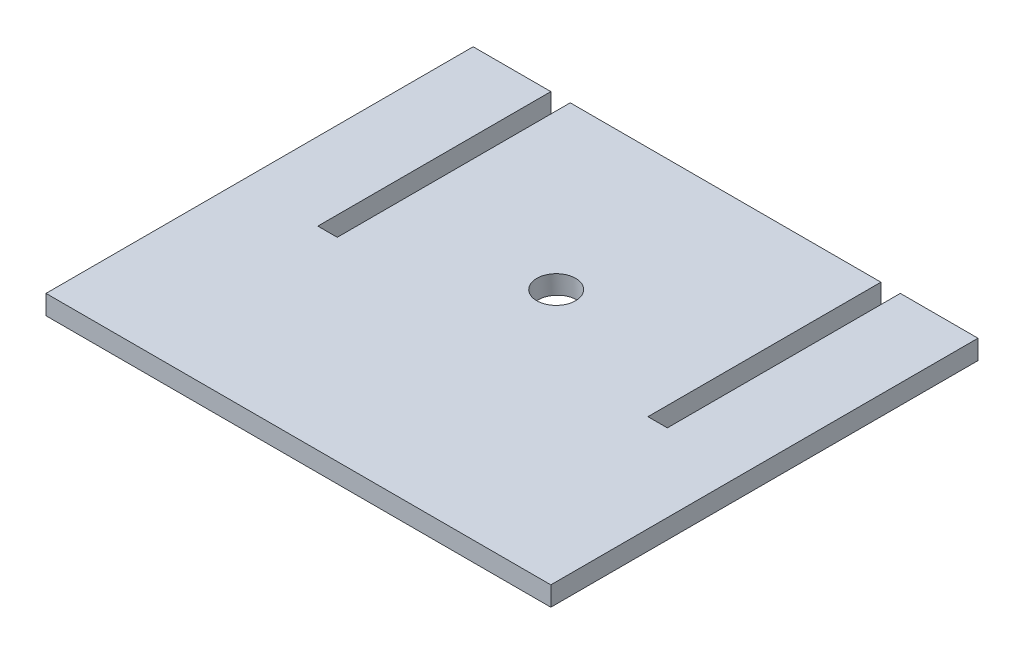
ISO-10303-21;
HEADER;
FILE_DESCRIPTION(('STEP AP214'),'2;1');
FILE_NAME('part.step','',(''),(''),'','','');
FILE_SCHEMA(('AUTOMOTIVE_DESIGN { 1 0 10303 214 1 1 1 1 }'));
ENDSEC;
DATA;
#1=APPLICATION_CONTEXT('core data for automotive mechanical design processes');
#2=APPLICATION_PROTOCOL_DEFINITION('international standard','automotive_design',2000,#1);
#3=PRODUCT_CONTEXT('',#1,'mechanical');
#4=PRODUCT('Part','Part','',(#3));
#5=PRODUCT_RELATED_PRODUCT_CATEGORY('part','',(#4));
#6=PRODUCT_DEFINITION_FORMATION('','',#4);
#7=PRODUCT_DEFINITION_CONTEXT('part definition',#1,'design');
#8=PRODUCT_DEFINITION('design','',#6,#7);
#9=PRODUCT_DEFINITION_SHAPE('','',#8);
#10=(LENGTH_UNIT() NAMED_UNIT(*) SI_UNIT(.MILLI.,.METRE.));
#11=(NAMED_UNIT(*) PLANE_ANGLE_UNIT() SI_UNIT($,.RADIAN.));
#12=(NAMED_UNIT(*) SI_UNIT($,.STERADIAN.) SOLID_ANGLE_UNIT());
#13=UNCERTAINTY_MEASURE_WITH_UNIT(LENGTH_MEASURE(1.E-05),#10,'distance_accuracy_value','');
#14=(GEOMETRIC_REPRESENTATION_CONTEXT(3) GLOBAL_UNCERTAINTY_ASSIGNED_CONTEXT((#13)) GLOBAL_UNIT_ASSIGNED_CONTEXT((#10,
#11,#12)) REPRESENTATION_CONTEXT('',''));
#15=CARTESIAN_POINT('',(0.,0.,0.));
#16=DIRECTION('',(0.,0.,1.));
#17=DIRECTION('',(1.,0.,0.));
#18=AXIS2_PLACEMENT_3D('',#15,#16,#17);
#19=CARTESIAN_POINT('',(-165.1,6.35,-139.7));
#20=DIRECTION('',(0.,0.,1.));
#21=DIRECTION('',(1.,0.,0.));
#22=AXIS2_PLACEMENT_3D('',#19,#20,#21);
#23=PLANE('',#22);
#24=DIRECTION('',(-1.,0.,0.));
#25=VECTOR('',#24,1.);
#26=CARTESIAN_POINT('',(-165.1,6.35,-139.7));
#27=LINE('',#26,#25);
#28=CARTESIAN_POINT('',(-114.3,6.35,-139.7));
#29=VERTEX_POINT('',#28);
#30=CARTESIAN_POINT('',(-165.1,6.35,-139.7));
#31=VERTEX_POINT('',#30);
#32=EDGE_CURVE('E239',#29,#31,#27,.T.);
#33=ORIENTED_EDGE('',*,*,#32,.F.);
#34=DIRECTION('',(0.,1.,0.));
#35=VECTOR('',#34,1.);
#36=CARTESIAN_POINT('',(-114.3,-6.35,-139.7));
#37=LINE('',#36,#35);
#38=CARTESIAN_POINT('',(-114.3,-6.35,-139.7));
#39=VERTEX_POINT('',#38);
#40=EDGE_CURVE('E213',#39,#29,#37,.T.);
#41=ORIENTED_EDGE('',*,*,#40,.F.);
#42=DIRECTION('',(-1.,0.,0.));
#43=VECTOR('',#42,1.);
#44=CARTESIAN_POINT('',(-165.1,-6.35,-139.7));
#45=LINE('',#44,#43);
#46=CARTESIAN_POINT('',(-165.1,-6.35,-139.7));
#47=VERTEX_POINT('',#46);
#48=EDGE_CURVE('E261',#39,#47,#45,.T.);
#49=ORIENTED_EDGE('',*,*,#48,.T.);
#50=DIRECTION('',(0.,-1.,0.));
#51=VECTOR('',#50,1.);
#52=CARTESIAN_POINT('',(-165.1,6.35,-139.7));
#53=LINE('',#52,#51);
#54=EDGE_CURVE('E245',#31,#47,#53,.T.);
#55=ORIENTED_EDGE('',*,*,#54,.F.);
#56=EDGE_LOOP('',(#33,#41,#49,#55));
#57=FACE_BOUND('',#56,.T.);
#58=ADVANCED_FACE('F41',(#57),#23,.F.);
#59=CARTESIAN_POINT('',(165.1,-6.35,-139.7));
#60=VERTEX_POINT('',#59);
#61=CARTESIAN_POINT('',(114.3,-6.35,-139.7));
#62=VERTEX_POINT('',#61);
#63=EDGE_CURVE('E203',#60,#62,#45,.T.);
#64=ORIENTED_EDGE('',*,*,#63,.T.);
#65=DIRECTION('',(0.,1.,0.));
#66=VECTOR('',#65,1.);
#67=CARTESIAN_POINT('',(114.3,-6.35,-139.7));
#68=LINE('',#67,#66);
#69=CARTESIAN_POINT('',(114.3,6.35,-139.7));
#70=VERTEX_POINT('',#69);
#71=EDGE_CURVE('E198',#62,#70,#68,.T.);
#72=ORIENTED_EDGE('',*,*,#71,.T.);
#73=CARTESIAN_POINT('',(165.1,6.35,-139.7));
#74=VERTEX_POINT('',#73);
#75=EDGE_CURVE('E237',#74,#70,#27,.T.);
#76=ORIENTED_EDGE('',*,*,#75,.F.);
#77=DIRECTION('',(0.,-1.,0.));
#78=VECTOR('',#77,1.);
#79=CARTESIAN_POINT('',(165.1,6.35,-139.7));
#80=LINE('',#79,#78);
#81=EDGE_CURVE('E202',#74,#60,#80,.T.);
#82=ORIENTED_EDGE('',*,*,#81,.T.);
#83=EDGE_LOOP('',(#64,#72,#76,#82));
#84=FACE_BOUND('',#83,.T.);
#85=ADVANCED_FACE('F285',(#84),#23,.F.);
#86=CARTESIAN_POINT('',(165.1,6.35,139.7));
#87=DIRECTION('',(-1.,0.,0.));
#88=DIRECTION('',(0.,0.,1.));
#89=AXIS2_PLACEMENT_3D('',#86,#87,#88);
#90=PLANE('',#89);
#91=DIRECTION('',(0.,0.,-1.));
#92=VECTOR('',#91,1.);
#93=CARTESIAN_POINT('',(165.1,-6.35,139.7));
#94=LINE('',#93,#92);
#95=CARTESIAN_POINT('',(165.1,-6.35,139.7));
#96=VERTEX_POINT('',#95);
#97=EDGE_CURVE('E244',#96,#60,#94,.T.);
#98=ORIENTED_EDGE('',*,*,#97,.T.);
#99=ORIENTED_EDGE('',*,*,#81,.F.);
#100=DIRECTION('',(0.,0.,-1.));
#101=VECTOR('',#100,1.);
#102=CARTESIAN_POINT('',(165.1,6.35,139.7));
#103=LINE('',#102,#101);
#104=CARTESIAN_POINT('',(165.1,6.35,139.7));
#105=VERTEX_POINT('',#104);
#106=EDGE_CURVE('E268',#105,#74,#103,.T.);
#107=ORIENTED_EDGE('',*,*,#106,.F.);
#108=DIRECTION('',(0.,-1.,0.));
#109=VECTOR('',#108,1.);
#110=CARTESIAN_POINT('',(165.1,6.35,139.7));
#111=LINE('',#110,#109);
#112=EDGE_CURVE('E252',#105,#96,#111,.T.);
#113=ORIENTED_EDGE('',*,*,#112,.T.);
#114=EDGE_LOOP('',(#98,#99,#107,#113));
#115=FACE_BOUND('',#114,.T.);
#116=ADVANCED_FACE('F282',(#115),#90,.F.);
#117=CARTESIAN_POINT('',(101.6,-6.35,-139.7));
#118=VERTEX_POINT('',#117);
#119=CARTESIAN_POINT('',(-101.6,-6.35,-139.7));
#120=VERTEX_POINT('',#119);
#121=EDGE_CURVE('E175',#118,#120,#45,.T.);
#122=ORIENTED_EDGE('',*,*,#121,.T.);
#123=DIRECTION('',(0.,1.,0.));
#124=VECTOR('',#123,1.);
#125=CARTESIAN_POINT('',(-101.6,-6.35,-139.7));
#126=LINE('',#125,#124);
#127=CARTESIAN_POINT('',(-101.6,6.35,-139.7));
#128=VERTEX_POINT('',#127);
#129=EDGE_CURVE('E77',#120,#128,#126,.T.);
#130=ORIENTED_EDGE('',*,*,#129,.T.);
#131=CARTESIAN_POINT('',(101.6,6.35,-139.7));
#132=VERTEX_POINT('',#131);
#133=EDGE_CURVE('E231',#132,#128,#27,.T.);
#134=ORIENTED_EDGE('',*,*,#133,.F.);
#135=DIRECTION('',(0.,1.,0.));
#136=VECTOR('',#135,1.);
#137=CARTESIAN_POINT('',(101.6,-6.35,-139.7));
#138=LINE('',#137,#136);
#139=EDGE_CURVE('E190',#118,#132,#138,.T.);
#140=ORIENTED_EDGE('',*,*,#139,.F.);
#141=EDGE_LOOP('',(#122,#130,#134,#140));
#142=FACE_BOUND('',#141,.T.);
#143=ADVANCED_FACE('F303',(#142),#23,.F.);
#144=CARTESIAN_POINT('',(-165.1,6.35,139.7));
#145=DIRECTION('',(1.,0.,0.));
#146=DIRECTION('',(0.,0.,-1.));
#147=AXIS2_PLACEMENT_3D('',#144,#145,#146);
#148=PLANE('',#147);
#149=DIRECTION('',(0.,0.,1.));
#150=VECTOR('',#149,1.);
#151=CARTESIAN_POINT('',(-165.1,-6.35,139.7));
#152=LINE('',#151,#150);
#153=CARTESIAN_POINT('',(-165.1,-6.35,139.7));
#154=VERTEX_POINT('',#153);
#155=EDGE_CURVE('E212',#47,#154,#152,.T.);
#156=ORIENTED_EDGE('',*,*,#155,.T.);
#157=DIRECTION('',(0.,-1.,0.));
#158=VECTOR('',#157,1.);
#159=CARTESIAN_POINT('',(-165.1,6.35,139.7));
#160=LINE('',#159,#158);
#161=CARTESIAN_POINT('',(-165.1,6.35,139.7));
#162=VERTEX_POINT('',#161);
#163=EDGE_CURVE('E249',#162,#154,#160,.T.);
#164=ORIENTED_EDGE('',*,*,#163,.F.);
#165=DIRECTION('',(0.,0.,1.));
#166=VECTOR('',#165,1.);
#167=CARTESIAN_POINT('',(-165.1,6.35,139.7));
#168=LINE('',#167,#166);
#169=EDGE_CURVE('E269',#31,#162,#168,.T.);
#170=ORIENTED_EDGE('',*,*,#169,.F.);
#171=ORIENTED_EDGE('',*,*,#54,.T.);
#172=EDGE_LOOP('',(#156,#164,#170,#171));
#173=FACE_BOUND('',#172,.T.);
#174=ADVANCED_FACE('F296',(#173),#148,.F.);
#175=CARTESIAN_POINT('',(-165.1,6.35,139.7));
#176=DIRECTION('',(0.,0.,-1.));
#177=DIRECTION('',(-1.,0.,0.));
#178=AXIS2_PLACEMENT_3D('',#175,#176,#177);
#179=PLANE('',#178);
#180=DIRECTION('',(1.,0.,0.));
#181=VECTOR('',#180,1.);
#182=CARTESIAN_POINT('',(-165.1,-6.35,139.7));
#183=LINE('',#182,#181);
#184=EDGE_CURVE('E248',#154,#96,#183,.T.);
#185=ORIENTED_EDGE('',*,*,#184,.T.);
#186=ORIENTED_EDGE('',*,*,#112,.F.);
#187=DIRECTION('',(1.,0.,0.));
#188=VECTOR('',#187,1.);
#189=CARTESIAN_POINT('',(-165.1,6.35,139.7));
#190=LINE('',#189,#188);
#191=EDGE_CURVE('E265',#162,#105,#190,.T.);
#192=ORIENTED_EDGE('',*,*,#191,.F.);
#193=ORIENTED_EDGE('',*,*,#163,.T.);
#194=EDGE_LOOP('',(#185,#186,#192,#193));
#195=FACE_BOUND('',#194,.T.);
#196=ADVANCED_FACE('F292',(#195),#179,.F.);
#197=CARTESIAN_POINT('',(0.,6.35,0.));
#198=DIRECTION('',(0.,-1.,0.));
#199=DIRECTION('',(0.,0.,-1.));
#200=AXIS2_PLACEMENT_3D('',#197,#198,#199);
#201=PLANE('',#200);
#202=CARTESIAN_POINT('',(-0.420618124768386,6.34999999999999,-29.3287996231999));
#203=DIRECTION('',(0.,-1.,0.));
#204=DIRECTION('',(0.0668404015348749,0.,0.997763679797304));
#205=AXIS2_PLACEMENT_3D('',#202,#203,#204);
#206=ELLIPSE('',#205,12.7300984739161,12.7);
#207=CARTESIAN_POINT('',(0.430266768806666,6.34999999999999,-16.6271697256833));
#208=VERTEX_POINT('',#207);
#209=EDGE_CURVE('E11',#208,#208,#206,.F.);
#210=ORIENTED_EDGE('',*,*,#209,.F.);
#211=EDGE_LOOP('',(#210));
#212=FACE_BOUND('',#211,.T.);
#213=DIRECTION('',(1.,0.,0.));
#214=VECTOR('',#213,1.);
#215=CARTESIAN_POINT('',(-114.3,6.35,12.7));
#216=LINE('',#215,#214);
#217=CARTESIAN_POINT('',(-114.3,6.35,12.7));
#218=VERTEX_POINT('',#217);
#219=CARTESIAN_POINT('',(-101.6,6.35,12.7));
#220=VERTEX_POINT('',#219);
#221=EDGE_CURVE('E206',#218,#220,#216,.T.);
#222=ORIENTED_EDGE('',*,*,#221,.F.);
#223=DIRECTION('',(0.,0.,1.));
#224=VECTOR('',#223,1.);
#225=CARTESIAN_POINT('',(-114.3,6.35,-139.7));
#226=LINE('',#225,#224);
#227=EDGE_CURVE('E197',#29,#218,#226,.T.);
#228=ORIENTED_EDGE('',*,*,#227,.F.);
#229=ORIENTED_EDGE('',*,*,#32,.T.);
#230=ORIENTED_EDGE('',*,*,#169,.T.);
#231=ORIENTED_EDGE('',*,*,#191,.T.);
#232=ORIENTED_EDGE('',*,*,#106,.T.);
#233=ORIENTED_EDGE('',*,*,#75,.T.);
#234=DIRECTION('',(0.,0.,-1.));
#235=VECTOR('',#234,1.);
#236=CARTESIAN_POINT('',(114.3,6.35,-139.7));
#237=LINE('',#236,#235);
#238=CARTESIAN_POINT('',(114.3,6.35,12.7));
#239=VERTEX_POINT('',#238);
#240=EDGE_CURVE('E187',#239,#70,#237,.T.);
#241=ORIENTED_EDGE('',*,*,#240,.F.);
#242=DIRECTION('',(1.,0.,0.));
#243=VECTOR('',#242,1.);
#244=CARTESIAN_POINT('',(114.3,6.35,12.7));
#245=LINE('',#244,#243);
#246=CARTESIAN_POINT('',(101.6,6.35,12.7));
#247=VERTEX_POINT('',#246);
#248=EDGE_CURVE('E169',#247,#239,#245,.T.);
#249=ORIENTED_EDGE('',*,*,#248,.F.);
#250=DIRECTION('',(0.,0.,1.));
#251=VECTOR('',#250,1.);
#252=CARTESIAN_POINT('',(101.6,6.35,-139.7));
#253=LINE('',#252,#251);
#254=EDGE_CURVE('E166',#132,#247,#253,.T.);
#255=ORIENTED_EDGE('',*,*,#254,.F.);
#256=ORIENTED_EDGE('',*,*,#133,.T.);
#257=DIRECTION('',(0.,0.,-1.));
#258=VECTOR('',#257,1.);
#259=CARTESIAN_POINT('',(-101.6,6.35,-139.7));
#260=LINE('',#259,#258);
#261=EDGE_CURVE('E84',#220,#128,#260,.T.);
#262=ORIENTED_EDGE('',*,*,#261,.F.);
#263=EDGE_LOOP('',(#222,#228,#229,#230,#231,#232,#233,#241,#249,#255,#256,#262));
#264=FACE_BOUND('',#263,.T.);
#265=ADVANCED_FACE('F43',(#212,#264),#201,.F.);
#266=CARTESIAN_POINT('',(0.,-6.35,0.));
#267=DIRECTION('',(0.,-1.,0.));
#268=DIRECTION('',(0.,0.,-1.));
#269=AXIS2_PLACEMENT_3D('',#266,#267,#268);
#270=PLANE('',#269);
#271=CARTESIAN_POINT('',(-0.479095155058251,-6.34999999999999,-30.2017186300553));
#272=DIRECTION('',(0.,-1.,0.));
#273=DIRECTION('',(0.0668404015348749,0.,0.997763679797304));
#274=AXIS2_PLACEMENT_3D('',#271,#272,#273);
#275=ELLIPSE('',#274,12.7300984739161,12.7);
#276=CARTESIAN_POINT('',(0.371789738516801,-6.34999999999999,-17.5000887325387));
#277=VERTEX_POINT('',#276);
#278=EDGE_CURVE('E226',#277,#277,#275,.F.);
#279=ORIENTED_EDGE('',*,*,#278,.T.);
#280=EDGE_LOOP('',(#279));
#281=FACE_BOUND('',#280,.T.);
#282=DIRECTION('',(0.,0.,1.));
#283=VECTOR('',#282,1.);
#284=CARTESIAN_POINT('',(-114.3,-6.35,-139.7));
#285=LINE('',#284,#283);
#286=CARTESIAN_POINT('',(-114.3,-6.35,12.7));
#287=VERTEX_POINT('',#286);
#288=EDGE_CURVE('E224',#39,#287,#285,.T.);
#289=ORIENTED_EDGE('',*,*,#288,.T.);
#290=DIRECTION('',(1.,0.,0.));
#291=VECTOR('',#290,1.);
#292=CARTESIAN_POINT('',(-114.3,-6.35,12.7));
#293=LINE('',#292,#291);
#294=CARTESIAN_POINT('',(-101.6,-6.35,12.7));
#295=VERTEX_POINT('',#294);
#296=EDGE_CURVE('E182',#287,#295,#293,.T.);
#297=ORIENTED_EDGE('',*,*,#296,.T.);
#298=DIRECTION('',(0.,0.,-1.));
#299=VECTOR('',#298,1.);
#300=CARTESIAN_POINT('',(-101.6,-6.35,-139.7));
#301=LINE('',#300,#299);
#302=EDGE_CURVE('E177',#295,#120,#301,.T.);
#303=ORIENTED_EDGE('',*,*,#302,.T.);
#304=ORIENTED_EDGE('',*,*,#121,.F.);
#305=DIRECTION('',(0.,0.,1.));
#306=VECTOR('',#305,1.);
#307=CARTESIAN_POINT('',(101.6,-6.35,-139.7));
#308=LINE('',#307,#306);
#309=CARTESIAN_POINT('',(101.6,-6.35,12.7));
#310=VERTEX_POINT('',#309);
#311=EDGE_CURVE('E160',#118,#310,#308,.T.);
#312=ORIENTED_EDGE('',*,*,#311,.T.);
#313=DIRECTION('',(1.,0.,0.));
#314=VECTOR('',#313,1.);
#315=CARTESIAN_POINT('',(114.3,-6.35,12.7));
#316=LINE('',#315,#314);
#317=CARTESIAN_POINT('',(114.3,-6.35,12.7));
#318=VERTEX_POINT('',#317);
#319=EDGE_CURVE('E147',#310,#318,#316,.T.);
#320=ORIENTED_EDGE('',*,*,#319,.T.);
#321=DIRECTION('',(0.,0.,-1.));
#322=VECTOR('',#321,1.);
#323=CARTESIAN_POINT('',(114.3,-6.35,-139.7));
#324=LINE('',#323,#322);
#325=EDGE_CURVE('E159',#318,#62,#324,.T.);
#326=ORIENTED_EDGE('',*,*,#325,.T.);
#327=ORIENTED_EDGE('',*,*,#63,.F.);
#328=ORIENTED_EDGE('',*,*,#97,.F.);
#329=ORIENTED_EDGE('',*,*,#184,.F.);
#330=ORIENTED_EDGE('',*,*,#155,.F.);
#331=ORIENTED_EDGE('',*,*,#48,.F.);
#332=EDGE_LOOP('',(#289,#297,#303,#304,#312,#320,#326,#327,#328,#329,#330,#331));
#333=FACE_BOUND('',#332,.T.);
#334=ADVANCED_FACE('F173',(#281,#333),#270,.T.);
#335=CARTESIAN_POINT('',(114.3,-6.35,-139.7));
#336=DIRECTION('',(1.,0.,0.));
#337=DIRECTION('',(0.,0.,-1.));
#338=AXIS2_PLACEMENT_3D('',#335,#336,#337);
#339=PLANE('',#338);
#340=ORIENTED_EDGE('',*,*,#240,.T.);
#341=ORIENTED_EDGE('',*,*,#71,.F.);
#342=ORIENTED_EDGE('',*,*,#325,.F.);
#343=DIRECTION('',(0.,1.,0.));
#344=VECTOR('',#343,1.);
#345=CARTESIAN_POINT('',(114.3,-6.35,12.7));
#346=LINE('',#345,#344);
#347=EDGE_CURVE('E153',#318,#239,#346,.T.);
#348=ORIENTED_EDGE('',*,*,#347,.T.);
#349=EDGE_LOOP('',(#340,#341,#342,#348));
#350=FACE_BOUND('',#349,.T.);
#351=ADVANCED_FACE('F287',(#350),#339,.F.);
#352=CARTESIAN_POINT('',(114.3,-6.35,12.7));
#353=DIRECTION('',(0.,0.,1.));
#354=DIRECTION('',(1.,0.,0.));
#355=AXIS2_PLACEMENT_3D('',#352,#353,#354);
#356=PLANE('',#355);
#357=ORIENTED_EDGE('',*,*,#248,.T.);
#358=ORIENTED_EDGE('',*,*,#347,.F.);
#359=ORIENTED_EDGE('',*,*,#319,.F.);
#360=DIRECTION('',(0.,1.,0.));
#361=VECTOR('',#360,1.);
#362=CARTESIAN_POINT('',(101.6,-6.35,12.7));
#363=LINE('',#362,#361);
#364=EDGE_CURVE('E151',#310,#247,#363,.T.);
#365=ORIENTED_EDGE('',*,*,#364,.T.);
#366=EDGE_LOOP('',(#357,#358,#359,#365));
#367=FACE_BOUND('',#366,.T.);
#368=ADVANCED_FACE('F150',(#367),#356,.F.);
#369=CARTESIAN_POINT('',(101.6,-6.35,-139.7));
#370=DIRECTION('',(-1.,0.,0.));
#371=DIRECTION('',(0.,0.,1.));
#372=AXIS2_PLACEMENT_3D('',#369,#370,#371);
#373=PLANE('',#372);
#374=ORIENTED_EDGE('',*,*,#254,.T.);
#375=ORIENTED_EDGE('',*,*,#364,.F.);
#376=ORIENTED_EDGE('',*,*,#311,.F.);
#377=ORIENTED_EDGE('',*,*,#139,.T.);
#378=EDGE_LOOP('',(#374,#375,#376,#377));
#379=FACE_BOUND('',#378,.T.);
#380=ADVANCED_FACE('F163',(#379),#373,.F.);
#381=CARTESIAN_POINT('',(-114.3,-6.35,-139.7));
#382=DIRECTION('',(-1.,0.,0.));
#383=DIRECTION('',(0.,0.,1.));
#384=AXIS2_PLACEMENT_3D('',#381,#382,#383);
#385=PLANE('',#384);
#386=ORIENTED_EDGE('',*,*,#227,.T.);
#387=DIRECTION('',(0.,1.,0.));
#388=VECTOR('',#387,1.);
#389=CARTESIAN_POINT('',(-114.3,-6.35,12.7));
#390=LINE('',#389,#388);
#391=EDGE_CURVE('E50',#287,#218,#390,.T.);
#392=ORIENTED_EDGE('',*,*,#391,.F.);
#393=ORIENTED_EDGE('',*,*,#288,.F.);
#394=ORIENTED_EDGE('',*,*,#40,.T.);
#395=EDGE_LOOP('',(#386,#392,#393,#394));
#396=FACE_BOUND('',#395,.T.);
#397=ADVANCED_FACE('F310',(#396),#385,.F.);
#398=CARTESIAN_POINT('',(-101.6,-6.35,-139.7));
#399=DIRECTION('',(1.,0.,0.));
#400=DIRECTION('',(0.,0.,-1.));
#401=AXIS2_PLACEMENT_3D('',#398,#399,#400);
#402=PLANE('',#401);
#403=ORIENTED_EDGE('',*,*,#261,.T.);
#404=ORIENTED_EDGE('',*,*,#129,.F.);
#405=ORIENTED_EDGE('',*,*,#302,.F.);
#406=DIRECTION('',(0.,1.,0.));
#407=VECTOR('',#406,1.);
#408=CARTESIAN_POINT('',(-101.6,-6.35,12.7));
#409=LINE('',#408,#407);
#410=EDGE_CURVE('E207',#295,#220,#409,.T.);
#411=ORIENTED_EDGE('',*,*,#410,.T.);
#412=EDGE_LOOP('',(#403,#404,#405,#411));
#413=FACE_BOUND('',#412,.T.);
#414=ADVANCED_FACE('F308',(#413),#402,.F.);
#415=CARTESIAN_POINT('',(-114.3,-6.35,12.7));
#416=DIRECTION('',(0.,0.,1.));
#417=DIRECTION('',(1.,0.,0.));
#418=AXIS2_PLACEMENT_3D('',#415,#416,#417);
#419=PLANE('',#418);
#420=ORIENTED_EDGE('',*,*,#221,.T.);
#421=ORIENTED_EDGE('',*,*,#410,.F.);
#422=ORIENTED_EDGE('',*,*,#296,.F.);
#423=ORIENTED_EDGE('',*,*,#391,.T.);
#424=EDGE_LOOP('',(#420,#421,#422,#423));
#425=FACE_BOUND('',#424,.T.);
#426=ADVANCED_FACE('F307',(#425),#419,.F.);
#427=CARTESIAN_POINT('',(-0.803083946952388,-76.7136562366382,-35.0380787025588));
#428=DIRECTION('',(0.00459360392299275,0.9976356448477,0.0685712690003091));
#429=DIRECTION('',(0.,-0.0685719924796867,0.99764617066742));
#430=AXIS2_PLACEMENT_3D('',#427,#428,#429);
#431=CYLINDRICAL_SURFACE('',#430,12.7);
#432=ORIENTED_EDGE('',*,*,#278,.F.);
#433=EDGE_LOOP('',(#432));
#434=FACE_BOUND('',#433,.T.);
#435=ORIENTED_EDGE('',*,*,#209,.T.);
#436=EDGE_LOOP('',(#435));
#437=FACE_BOUND('',#436,.T.);
#438=ADVANCED_FACE('F316',(#434,#437),#431,.F.);
#439=CLOSED_SHELL('',(#58,#85,#116,#143,#174,#196,#265,#334,#351,#368,#380,#397,#414,#426,#438));
#440=MANIFOLD_SOLID_BREP('B2',#439);
#441=ADVANCED_BREP_SHAPE_REPRESENTATION('',(#18,#440),#14);
#442=SHAPE_DEFINITION_REPRESENTATION(#9,#441);
ENDSEC;
END-ISO-10303-21;
